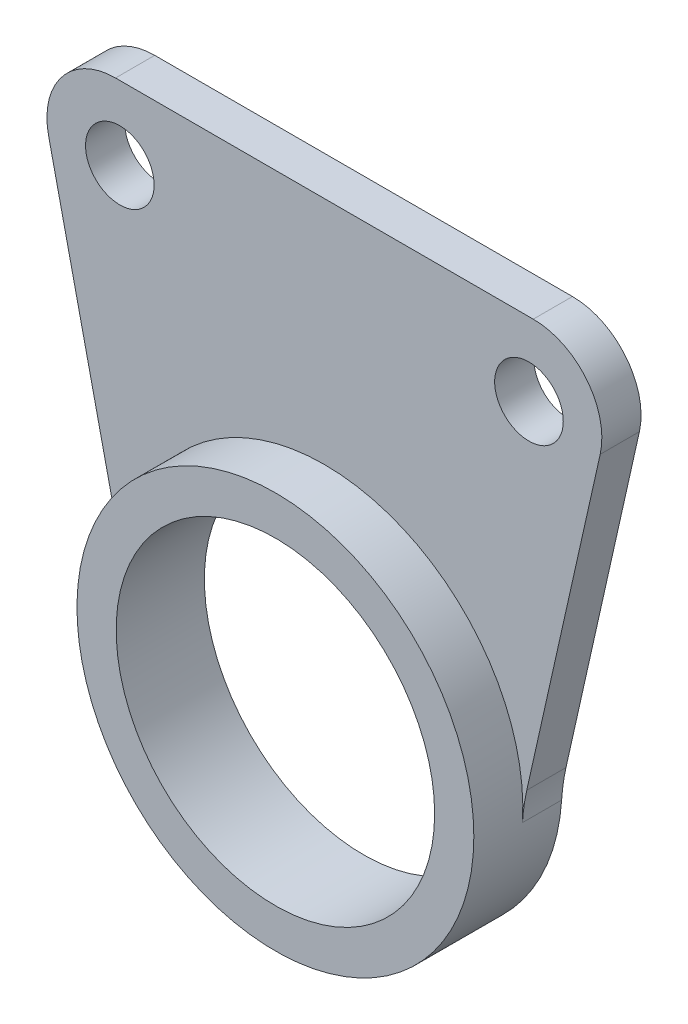
ISO-10303-21;
HEADER;
FILE_DESCRIPTION(('STEP AP214'),'2;1');
FILE_NAME('part.step','',(''),(''),'','','');
FILE_SCHEMA(('AUTOMOTIVE_DESIGN { 1 0 10303 214 1 1 1 1 }'));
ENDSEC;
DATA;
#1=APPLICATION_CONTEXT('core data for automotive mechanical design processes');
#2=APPLICATION_PROTOCOL_DEFINITION('international standard','automotive_design',2000,#1);
#3=PRODUCT_CONTEXT('',#1,'mechanical');
#4=PRODUCT('Part','Part','',(#3));
#5=PRODUCT_RELATED_PRODUCT_CATEGORY('part','',(#4));
#6=PRODUCT_DEFINITION_FORMATION('','',#4);
#7=PRODUCT_DEFINITION_CONTEXT('part definition',#1,'design');
#8=PRODUCT_DEFINITION('design','',#6,#7);
#9=PRODUCT_DEFINITION_SHAPE('','',#8);
#10=(LENGTH_UNIT() NAMED_UNIT(*) SI_UNIT(.MILLI.,.METRE.));
#11=(NAMED_UNIT(*) PLANE_ANGLE_UNIT() SI_UNIT($,.RADIAN.));
#12=(NAMED_UNIT(*) SI_UNIT($,.STERADIAN.) SOLID_ANGLE_UNIT());
#13=UNCERTAINTY_MEASURE_WITH_UNIT(LENGTH_MEASURE(1.E-05),#10,'distance_accuracy_value','');
#14=(GEOMETRIC_REPRESENTATION_CONTEXT(3) GLOBAL_UNCERTAINTY_ASSIGNED_CONTEXT((#13)) GLOBAL_UNIT_ASSIGNED_CONTEXT((#10,
#11,#12)) REPRESENTATION_CONTEXT('',''));
#15=CARTESIAN_POINT('',(0.,0.,0.));
#16=DIRECTION('',(0.,0.,1.));
#17=DIRECTION('',(1.,0.,0.));
#18=AXIS2_PLACEMENT_3D('',#15,#16,#17);
#19=CARTESIAN_POINT('',(0.,0.,4.5));
#20=DIRECTION('',(0.,0.,-1.));
#21=DIRECTION('',(-1.,0.,0.));
#22=AXIS2_PLACEMENT_3D('',#19,#20,#21);
#23=CYLINDRICAL_SURFACE('',#22,8.125);
#24=CARTESIAN_POINT('',(0.,0.,4.5));
#25=DIRECTION('',(0.,0.,1.));
#26=DIRECTION('',(1.,0.,0.));
#27=AXIS2_PLACEMENT_3D('',#24,#25,#26);
#28=CIRCLE('',#27,8.125);
#29=CARTESIAN_POINT('',(8.125,0.,4.5));
#30=VERTEX_POINT('',#29);
#31=EDGE_CURVE('E144',#30,#30,#28,.T.);
#32=ORIENTED_EDGE('',*,*,#31,.T.);
#33=EDGE_LOOP('',(#32));
#34=FACE_BOUND('',#33,.T.);
#35=CARTESIAN_POINT('',(0.,0.,0.));
#36=DIRECTION('',(0.,0.,1.));
#37=DIRECTION('',(1.,0.,0.));
#38=AXIS2_PLACEMENT_3D('',#35,#36,#37);
#39=CIRCLE('',#38,8.125);
#40=CARTESIAN_POINT('',(8.125,0.,0.));
#41=VERTEX_POINT('',#40);
#42=EDGE_CURVE('E209',#41,#41,#39,.T.);
#43=ORIENTED_EDGE('',*,*,#42,.F.);
#44=EDGE_LOOP('',(#43));
#45=FACE_BOUND('',#44,.T.);
#46=ADVANCED_FACE('F45',(#34,#45),#23,.F.);
#47=CARTESIAN_POINT('',(0.,0.,4.5));
#48=DIRECTION('',(0.,0.,-1.));
#49=DIRECTION('',(-1.,0.,0.));
#50=AXIS2_PLACEMENT_3D('',#47,#48,#49);
#51=CYLINDRICAL_SURFACE('',#50,10.125);
#52=CARTESIAN_POINT('',(0.,0.,0.));
#53=DIRECTION('',(0.,0.,1.));
#54=DIRECTION('',(1.,0.,0.));
#55=AXIS2_PLACEMENT_3D('',#52,#53,#54);
#56=CIRCLE('',#55,10.125);
#57=CARTESIAN_POINT('',(-10.1041053362177,-0.650138719517837,0.));
#58=VERTEX_POINT('',#57);
#59=CARTESIAN_POINT('',(10.1041053362177,-0.650138719517837,0.));
#60=VERTEX_POINT('',#59);
#61=EDGE_CURVE('E147',#58,#60,#56,.T.);
#62=ORIENTED_EDGE('',*,*,#61,.T.);
#63=DIRECTION('',(0.,0.,-1.));
#64=VECTOR('',#63,1.);
#65=CARTESIAN_POINT('',(10.1041053362177,-0.650138719517837,4.5));
#66=LINE('',#65,#64);
#67=CARTESIAN_POINT('',(10.1041053362177,-0.650138719517837,2.));
#68=VERTEX_POINT('',#67);
#69=EDGE_CURVE('E171',#60,#68,#66,.F.);
#70=ORIENTED_EDGE('',*,*,#69,.T.);
#71=CARTESIAN_POINT('',(0.,0.,2.));
#72=DIRECTION('',(0.,0.,1.));
#73=DIRECTION('',(1.,0.,0.));
#74=AXIS2_PLACEMENT_3D('',#71,#72,#73);
#75=CIRCLE('',#74,10.125);
#76=CARTESIAN_POINT('',(-10.1041053362177,-0.650138719517837,2.));
#77=VERTEX_POINT('',#76);
#78=EDGE_CURVE('E190',#68,#77,#75,.T.);
#79=ORIENTED_EDGE('',*,*,#78,.T.);
#80=DIRECTION('',(0.,0.,-1.));
#81=VECTOR('',#80,1.);
#82=CARTESIAN_POINT('',(-10.1041053362177,-0.650138719517837,4.5));
#83=LINE('',#82,#81);
#84=EDGE_CURVE('E167',#77,#58,#83,.T.);
#85=ORIENTED_EDGE('',*,*,#84,.T.);
#86=EDGE_LOOP('',(#62,#70,#79,#85));
#87=FACE_BOUND('',#86,.T.);
#88=CARTESIAN_POINT('',(0.,0.,4.5));
#89=DIRECTION('',(0.,0.,1.));
#90=DIRECTION('',(1.,0.,0.));
#91=AXIS2_PLACEMENT_3D('',#88,#89,#90);
#92=CIRCLE('',#91,10.125);
#93=CARTESIAN_POINT('',(10.125,0.,4.5));
#94=VERTEX_POINT('',#93);
#95=EDGE_CURVE('E138',#94,#94,#92,.T.);
#96=ORIENTED_EDGE('',*,*,#95,.F.);
#97=EDGE_LOOP('',(#96));
#98=FACE_BOUND('',#97,.T.);
#99=ADVANCED_FACE('F205',(#87,#98),#51,.T.);
#100=CARTESIAN_POINT('',(0.,0.,4.5));
#101=DIRECTION('',(0.,0.,1.));
#102=DIRECTION('',(1.,0.,0.));
#103=AXIS2_PLACEMENT_3D('',#100,#101,#102);
#104=PLANE('',#103);
#105=ORIENTED_EDGE('',*,*,#31,.F.);
#106=EDGE_LOOP('',(#105));
#107=FACE_BOUND('',#106,.T.);
#108=ORIENTED_EDGE('',*,*,#95,.T.);
#109=EDGE_LOOP('',(#108));
#110=FACE_BOUND('',#109,.T.);
#111=ADVANCED_FACE('F263',(#107,#110),#104,.T.);
#112=CARTESIAN_POINT('',(0.,0.,0.));
#113=DIRECTION('',(0.,0.,1.));
#114=DIRECTION('',(1.,0.,0.));
#115=AXIS2_PLACEMENT_3D('',#112,#113,#114);
#116=PLANE('',#115);
#117=ORIENTED_EDGE('',*,*,#42,.T.);
#118=EDGE_LOOP('',(#117));
#119=FACE_BOUND('',#118,.T.);
#120=DIRECTION('',(1.,0.,0.));
#121=VECTOR('',#120,1.);
#122=CARTESIAN_POINT('',(0.,21.875,0.));
#123=LINE('',#122,#121);
#124=CARTESIAN_POINT('',(-10.6566955961381,21.875,0.));
#125=VERTEX_POINT('',#124);
#126=CARTESIAN_POINT('',(10.6566955961381,21.875,0.));
#127=VERTEX_POINT('',#126);
#128=EDGE_CURVE('E113',#125,#127,#123,.T.);
#129=ORIENTED_EDGE('',*,*,#128,.T.);
#130=CARTESIAN_POINT('',(10.6566955961381,18.375,0.));
#131=DIRECTION('',(0.,0.,1.));
#132=DIRECTION('',(1.,0.,0.));
#133=AXIS2_PLACEMENT_3D('',#130,#131,#132);
#134=CIRCLE('',#133,3.5);
#135=CARTESIAN_POINT('',(14.0719591156941,17.6095099007892,0.));
#136=VERTEX_POINT('',#135);
#137=EDGE_CURVE('E120',#127,#136,#134,.F.);
#138=ORIENTED_EDGE('',*,*,#137,.T.);
#139=DIRECTION('',(-0.218711456917381,-0.975789577016006,0.));
#140=VECTOR('',#139,1.);
#141=CARTESIAN_POINT('',(9.6406736484574,-2.1608406453439,0.));
#142=LINE('',#141,#140);
#143=CARTESIAN_POINT('',(10.3255728610875,0.8948635340828,0.));
#144=VERTEX_POINT('',#143);
#145=EDGE_CURVE('E131',#136,#144,#142,.T.);
#146=ORIENTED_EDGE('',*,*,#145,.T.);
#147=CARTESIAN_POINT('',(20.0834686312476,-1.29225103509101,0.));
#148=DIRECTION('',(0.,0.,1.));
#149=DIRECTION('',(1.,0.,0.));
#150=AXIS2_PLACEMENT_3D('',#147,#148,#149);
#151=CIRCLE('',#150,10.);
#152=EDGE_CURVE('E177',#144,#60,#151,.T.);
#153=ORIENTED_EDGE('',*,*,#152,.T.);
#154=ORIENTED_EDGE('',*,*,#61,.F.);
#155=CARTESIAN_POINT('',(-20.0834686312476,-1.29225103509101,0.));
#156=DIRECTION('',(0.,0.,1.));
#157=DIRECTION('',(1.,0.,0.));
#158=AXIS2_PLACEMENT_3D('',#155,#156,#157);
#159=CIRCLE('',#158,10.);
#160=CARTESIAN_POINT('',(-10.3255728610875,0.8948635340828,0.));
#161=VERTEX_POINT('',#160);
#162=EDGE_CURVE('E54',#58,#161,#159,.T.);
#163=ORIENTED_EDGE('',*,*,#162,.T.);
#164=DIRECTION('',(-0.218711456917381,0.975789577016006,0.));
#165=VECTOR('',#164,1.);
#166=CARTESIAN_POINT('',(-9.6406736484574,-2.1608406453439,0.));
#167=LINE('',#166,#165);
#168=CARTESIAN_POINT('',(-14.0719591156941,17.6095099007892,0.));
#169=VERTEX_POINT('',#168);
#170=EDGE_CURVE('E114',#161,#169,#167,.T.);
#171=ORIENTED_EDGE('',*,*,#170,.T.);
#172=CARTESIAN_POINT('',(-10.6566955961381,18.375,0.));
#173=DIRECTION('',(0.,0.,1.));
#174=DIRECTION('',(1.,0.,0.));
#175=AXIS2_PLACEMENT_3D('',#172,#173,#174);
#176=CIRCLE('',#175,3.5);
#177=EDGE_CURVE('E109',#169,#125,#176,.F.);
#178=ORIENTED_EDGE('',*,*,#177,.T.);
#179=EDGE_LOOP('',(#129,#138,#146,#153,#154,#163,#171,#178));
#180=FACE_BOUND('',#179,.T.);
#181=CARTESIAN_POINT('',(10.4375,18.125,0.));
#182=DIRECTION('',(0.,0.,1.));
#183=DIRECTION('',(1.,0.,0.));
#184=AXIS2_PLACEMENT_3D('',#181,#182,#183);
#185=CIRCLE('',#184,1.75);
#186=CARTESIAN_POINT('',(12.1875,18.125,0.));
#187=VERTEX_POINT('',#186);
#188=EDGE_CURVE('E230',#187,#187,#185,.T.);
#189=ORIENTED_EDGE('',*,*,#188,.T.);
#190=EDGE_LOOP('',(#189));
#191=FACE_BOUND('',#190,.T.);
#192=CARTESIAN_POINT('',(-10.4375,18.125,0.));
#193=DIRECTION('',(0.,0.,1.));
#194=DIRECTION('',(1.,0.,0.));
#195=AXIS2_PLACEMENT_3D('',#192,#193,#194);
#196=CIRCLE('',#195,1.75);
#197=CARTESIAN_POINT('',(-8.6875,18.125,0.));
#198=VERTEX_POINT('',#197);
#199=EDGE_CURVE('E226',#198,#198,#196,.T.);
#200=ORIENTED_EDGE('',*,*,#199,.T.);
#201=EDGE_LOOP('',(#200));
#202=FACE_BOUND('',#201,.T.);
#203=ADVANCED_FACE('F111',(#119,#180,#191,#202),#116,.F.);
#204=CARTESIAN_POINT('',(9.6406736484574,-2.1608406453439,2.));
#205=DIRECTION('',(0.975789577016007,-0.218711456917381,0.));
#206=DIRECTION('',(0.218711456917381,0.975789577016007,0.));
#207=AXIS2_PLACEMENT_3D('',#204,#205,#206);
#208=PLANE('',#207);
#209=DIRECTION('',(-0.218711456917381,-0.975789577016006,0.));
#210=VECTOR('',#209,1.);
#211=CARTESIAN_POINT('',(9.6406736484574,-2.1608406453439,2.));
#212=LINE('',#211,#210);
#213=CARTESIAN_POINT('',(14.0719591156941,17.6095099007892,2.));
#214=VERTEX_POINT('',#213);
#215=CARTESIAN_POINT('',(10.3255728610875,0.8948635340828,2.));
#216=VERTEX_POINT('',#215);
#217=EDGE_CURVE('E188',#214,#216,#212,.T.);
#218=ORIENTED_EDGE('',*,*,#217,.T.);
#219=DIRECTION('',(0.,0.,-1.));
#220=VECTOR('',#219,1.);
#221=CARTESIAN_POINT('',(10.3255728610875,0.894863534082799,2.));
#222=LINE('',#221,#220);
#223=EDGE_CURVE('E163',#216,#144,#222,.T.);
#224=ORIENTED_EDGE('',*,*,#223,.T.);
#225=ORIENTED_EDGE('',*,*,#145,.F.);
#226=DIRECTION('',(0.,0.,-1.));
#227=VECTOR('',#226,1.);
#228=CARTESIAN_POINT('',(14.0719591156941,17.6095099007892,2.));
#229=LINE('',#228,#227);
#230=EDGE_CURVE('E152',#136,#214,#229,.F.);
#231=ORIENTED_EDGE('',*,*,#230,.T.);
#232=EDGE_LOOP('',(#218,#224,#225,#231));
#233=FACE_BOUND('',#232,.T.);
#234=ADVANCED_FACE('F195',(#233),#208,.T.);
#235=CARTESIAN_POINT('',(0.,21.875,2.));
#236=DIRECTION('',(0.,1.,0.));
#237=DIRECTION('',(0.,0.,1.));
#238=AXIS2_PLACEMENT_3D('',#235,#236,#237);
#239=PLANE('',#238);
#240=DIRECTION('',(1.,0.,0.));
#241=VECTOR('',#240,1.);
#242=CARTESIAN_POINT('',(0.,21.875,2.));
#243=LINE('',#242,#241);
#244=CARTESIAN_POINT('',(-10.6566955961381,21.875,2.));
#245=VERTEX_POINT('',#244);
#246=CARTESIAN_POINT('',(10.6566955961381,21.875,2.));
#247=VERTEX_POINT('',#246);
#248=EDGE_CURVE('E200',#245,#247,#243,.T.);
#249=ORIENTED_EDGE('',*,*,#248,.T.);
#250=DIRECTION('',(0.,0.,-1.));
#251=VECTOR('',#250,1.);
#252=CARTESIAN_POINT('',(10.6566955961381,21.875,2.));
#253=LINE('',#252,#251);
#254=EDGE_CURVE('E121',#247,#127,#253,.T.);
#255=ORIENTED_EDGE('',*,*,#254,.T.);
#256=ORIENTED_EDGE('',*,*,#128,.F.);
#257=DIRECTION('',(0.,0.,-1.));
#258=VECTOR('',#257,1.);
#259=CARTESIAN_POINT('',(-10.6566955961381,21.875,2.));
#260=LINE('',#259,#258);
#261=EDGE_CURVE('E127',#125,#245,#260,.F.);
#262=ORIENTED_EDGE('',*,*,#261,.T.);
#263=EDGE_LOOP('',(#249,#255,#256,#262));
#264=FACE_BOUND('',#263,.T.);
#265=ADVANCED_FACE('F126',(#264),#239,.T.);
#266=CARTESIAN_POINT('',(-10.4375,18.125,2.));
#267=DIRECTION('',(0.,0.,-1.));
#268=DIRECTION('',(-1.,0.,0.));
#269=AXIS2_PLACEMENT_3D('',#266,#267,#268);
#270=CYLINDRICAL_SURFACE('',#269,1.75);
#271=CARTESIAN_POINT('',(-10.4375,18.125,2.));
#272=DIRECTION('',(0.,0.,1.));
#273=DIRECTION('',(1.,0.,0.));
#274=AXIS2_PLACEMENT_3D('',#271,#272,#273);
#275=CIRCLE('',#274,1.75);
#276=CARTESIAN_POINT('',(-8.6875,18.125,2.));
#277=VERTEX_POINT('',#276);
#278=EDGE_CURVE('E238',#277,#277,#275,.T.);
#279=ORIENTED_EDGE('',*,*,#278,.T.);
#280=EDGE_LOOP('',(#279));
#281=FACE_BOUND('',#280,.T.);
#282=ORIENTED_EDGE('',*,*,#199,.F.);
#283=EDGE_LOOP('',(#282));
#284=FACE_BOUND('',#283,.T.);
#285=ADVANCED_FACE('F256',(#281,#284),#270,.F.);
#286=CARTESIAN_POINT('',(10.4375,18.125,2.));
#287=DIRECTION('',(0.,0.,-1.));
#288=DIRECTION('',(-1.,0.,0.));
#289=AXIS2_PLACEMENT_3D('',#286,#287,#288);
#290=CYLINDRICAL_SURFACE('',#289,1.75);
#291=CARTESIAN_POINT('',(10.4375,18.125,2.));
#292=DIRECTION('',(0.,0.,1.));
#293=DIRECTION('',(1.,0.,0.));
#294=AXIS2_PLACEMENT_3D('',#291,#292,#293);
#295=CIRCLE('',#294,1.75);
#296=CARTESIAN_POINT('',(12.1875,18.125,2.));
#297=VERTEX_POINT('',#296);
#298=EDGE_CURVE('E222',#297,#297,#295,.T.);
#299=ORIENTED_EDGE('',*,*,#298,.T.);
#300=EDGE_LOOP('',(#299));
#301=FACE_BOUND('',#300,.T.);
#302=ORIENTED_EDGE('',*,*,#188,.F.);
#303=EDGE_LOOP('',(#302));
#304=FACE_BOUND('',#303,.T.);
#305=ADVANCED_FACE('F246',(#301,#304),#290,.F.);
#306=CARTESIAN_POINT('',(-9.6406736484574,-2.1608406453439,2.));
#307=DIRECTION('',(-0.975789577016007,-0.218711456917381,0.));
#308=DIRECTION('',(0.218711456917381,-0.975789577016007,0.));
#309=AXIS2_PLACEMENT_3D('',#306,#307,#308);
#310=PLANE('',#309);
#311=ORIENTED_EDGE('',*,*,#170,.F.);
#312=DIRECTION('',(0.,0.,-1.));
#313=VECTOR('',#312,1.);
#314=CARTESIAN_POINT('',(-10.3255728610875,0.894863534082799,2.));
#315=LINE('',#314,#313);
#316=CARTESIAN_POINT('',(-10.3255728610875,0.8948635340828,2.));
#317=VERTEX_POINT('',#316);
#318=EDGE_CURVE('E67',#161,#317,#315,.F.);
#319=ORIENTED_EDGE('',*,*,#318,.T.);
#320=DIRECTION('',(-0.218711456917381,0.975789577016006,0.));
#321=VECTOR('',#320,1.);
#322=CARTESIAN_POINT('',(-9.6406736484574,-2.1608406453439,2.));
#323=LINE('',#322,#321);
#324=CARTESIAN_POINT('',(-14.0719591156941,17.6095099007892,2.));
#325=VERTEX_POINT('',#324);
#326=EDGE_CURVE('E215',#317,#325,#323,.T.);
#327=ORIENTED_EDGE('',*,*,#326,.T.);
#328=DIRECTION('',(0.,0.,-1.));
#329=VECTOR('',#328,1.);
#330=CARTESIAN_POINT('',(-14.0719591156941,17.6095099007892,2.));
#331=LINE('',#330,#329);
#332=EDGE_CURVE('E160',#325,#169,#331,.T.);
#333=ORIENTED_EDGE('',*,*,#332,.T.);
#334=EDGE_LOOP('',(#311,#319,#327,#333));
#335=FACE_BOUND('',#334,.T.);
#336=ADVANCED_FACE('F252',(#335),#310,.T.);
#337=CARTESIAN_POINT('',(0.,0.,2.));
#338=DIRECTION('',(0.,0.,1.));
#339=DIRECTION('',(1.,0.,0.));
#340=AXIS2_PLACEMENT_3D('',#337,#338,#339);
#341=PLANE('',#340);
#342=ORIENTED_EDGE('',*,*,#298,.F.);
#343=EDGE_LOOP('',(#342));
#344=FACE_BOUND('',#343,.T.);
#345=ORIENTED_EDGE('',*,*,#278,.F.);
#346=EDGE_LOOP('',(#345));
#347=FACE_BOUND('',#346,.T.);
#348=ORIENTED_EDGE('',*,*,#217,.F.);
#349=CARTESIAN_POINT('',(10.6566955961381,18.375,2.));
#350=DIRECTION('',(0.,0.,1.));
#351=DIRECTION('',(1.,0.,0.));
#352=AXIS2_PLACEMENT_3D('',#349,#350,#351);
#353=CIRCLE('',#352,3.5);
#354=EDGE_CURVE('E157',#214,#247,#353,.T.);
#355=ORIENTED_EDGE('',*,*,#354,.T.);
#356=ORIENTED_EDGE('',*,*,#248,.F.);
#357=CARTESIAN_POINT('',(-10.6566955961381,18.375,2.));
#358=DIRECTION('',(0.,0.,1.));
#359=DIRECTION('',(1.,0.,0.));
#360=AXIS2_PLACEMENT_3D('',#357,#358,#359);
#361=CIRCLE('',#360,3.5);
#362=EDGE_CURVE('E136',#245,#325,#361,.T.);
#363=ORIENTED_EDGE('',*,*,#362,.T.);
#364=ORIENTED_EDGE('',*,*,#326,.F.);
#365=CARTESIAN_POINT('',(-20.0834686312476,-1.29225103509101,2.));
#366=DIRECTION('',(0.,0.,1.));
#367=DIRECTION('',(1.,0.,0.));
#368=AXIS2_PLACEMENT_3D('',#365,#366,#367);
#369=CIRCLE('',#368,10.);
#370=EDGE_CURVE('E11',#317,#77,#369,.F.);
#371=ORIENTED_EDGE('',*,*,#370,.T.);
#372=ORIENTED_EDGE('',*,*,#78,.F.);
#373=CARTESIAN_POINT('',(20.0834686312476,-1.29225103509101,2.));
#374=DIRECTION('',(0.,0.,1.));
#375=DIRECTION('',(1.,0.,0.));
#376=AXIS2_PLACEMENT_3D('',#373,#374,#375);
#377=CIRCLE('',#376,10.);
#378=EDGE_CURVE('E180',#68,#216,#377,.F.);
#379=ORIENTED_EDGE('',*,*,#378,.T.);
#380=EDGE_LOOP('',(#348,#355,#356,#363,#364,#371,#372,#379));
#381=FACE_BOUND('',#380,.T.);
#382=ADVANCED_FACE('F187',(#344,#347,#381),#341,.T.);
#383=CARTESIAN_POINT('',(10.6566955961381,18.375,2.));
#384=DIRECTION('',(0.,0.,-1.));
#385=DIRECTION('',(-1.,0.,0.));
#386=AXIS2_PLACEMENT_3D('',#383,#384,#385);
#387=CYLINDRICAL_SURFACE('',#386,3.5);
#388=ORIENTED_EDGE('',*,*,#354,.F.);
#389=ORIENTED_EDGE('',*,*,#230,.F.);
#390=ORIENTED_EDGE('',*,*,#137,.F.);
#391=ORIENTED_EDGE('',*,*,#254,.F.);
#392=EDGE_LOOP('',(#388,#389,#390,#391));
#393=FACE_BOUND('',#392,.T.);
#394=ADVANCED_FACE('F251',(#393),#387,.T.);
#395=CARTESIAN_POINT('',(-10.6566955961381,18.375,2.));
#396=DIRECTION('',(0.,0.,-1.));
#397=DIRECTION('',(-1.,0.,0.));
#398=AXIS2_PLACEMENT_3D('',#395,#396,#397);
#399=CYLINDRICAL_SURFACE('',#398,3.5);
#400=ORIENTED_EDGE('',*,*,#362,.F.);
#401=ORIENTED_EDGE('',*,*,#261,.F.);
#402=ORIENTED_EDGE('',*,*,#177,.F.);
#403=ORIENTED_EDGE('',*,*,#332,.F.);
#404=EDGE_LOOP('',(#400,#401,#402,#403));
#405=FACE_BOUND('',#404,.T.);
#406=ADVANCED_FACE('F134',(#405),#399,.T.);
#407=CARTESIAN_POINT('',(20.0834686312476,-1.29225103509101,4.5));
#408=DIRECTION('',(0.,0.,-1.));
#409=DIRECTION('',(-1.,0.,0.));
#410=AXIS2_PLACEMENT_3D('',#407,#408,#409);
#411=CYLINDRICAL_SURFACE('',#410,10.);
#412=ORIENTED_EDGE('',*,*,#378,.F.);
#413=ORIENTED_EDGE('',*,*,#69,.F.);
#414=ORIENTED_EDGE('',*,*,#152,.F.);
#415=ORIENTED_EDGE('',*,*,#223,.F.);
#416=EDGE_LOOP('',(#412,#413,#414,#415));
#417=FACE_BOUND('',#416,.T.);
#418=ADVANCED_FACE('F202',(#417),#411,.F.);
#419=CARTESIAN_POINT('',(-20.0834686312476,-1.29225103509101,4.5));
#420=DIRECTION('',(0.,0.,-1.));
#421=DIRECTION('',(-1.,0.,0.));
#422=AXIS2_PLACEMENT_3D('',#419,#420,#421);
#423=CYLINDRICAL_SURFACE('',#422,10.);
#424=ORIENTED_EDGE('',*,*,#370,.F.);
#425=ORIENTED_EDGE('',*,*,#318,.F.);
#426=ORIENTED_EDGE('',*,*,#162,.F.);
#427=ORIENTED_EDGE('',*,*,#84,.F.);
#428=EDGE_LOOP('',(#424,#425,#426,#427));
#429=FACE_BOUND('',#428,.T.);
#430=ADVANCED_FACE('F47',(#429),#423,.F.);
#431=CLOSED_SHELL('',(#46,#99,#111,#203,#234,#265,#285,#305,#336,#382,#394,#406,#418,#430));
#432=MANIFOLD_SOLID_BREP('B2',#431);
#433=ADVANCED_BREP_SHAPE_REPRESENTATION('',(#18,#432),#14);
#434=SHAPE_DEFINITION_REPRESENTATION(#9,#433);
ENDSEC;
END-ISO-10303-21;
